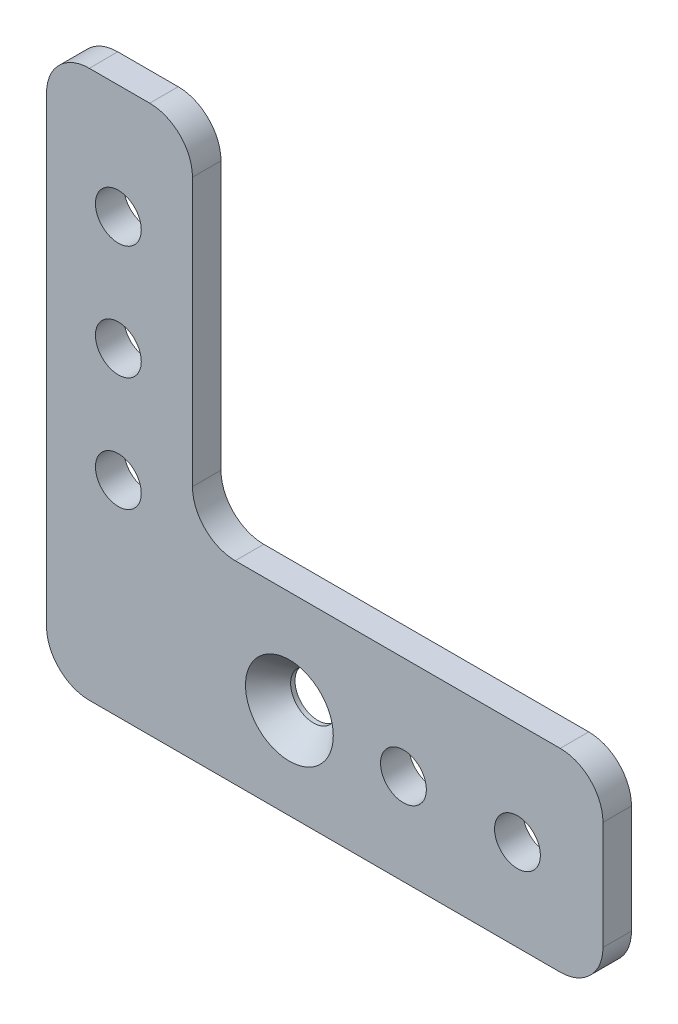
ISO-10303-21;
HEADER;
FILE_DESCRIPTION(('STEP AP214'),'2;1');
FILE_NAME('part.step','',(''),(''),'','','');
FILE_SCHEMA(('AUTOMOTIVE_DESIGN { 1 0 10303 214 1 1 1 1 }'));
ENDSEC;
DATA;
#1=APPLICATION_CONTEXT('core data for automotive mechanical design processes');
#2=APPLICATION_PROTOCOL_DEFINITION('international standard','automotive_design',2000,#1);
#3=PRODUCT_CONTEXT('',#1,'mechanical');
#4=PRODUCT('Part','Part','',(#3));
#5=PRODUCT_RELATED_PRODUCT_CATEGORY('part','',(#4));
#6=PRODUCT_DEFINITION_FORMATION('','',#4);
#7=PRODUCT_DEFINITION_CONTEXT('part definition',#1,'design');
#8=PRODUCT_DEFINITION('design','',#6,#7);
#9=PRODUCT_DEFINITION_SHAPE('','',#8);
#10=(LENGTH_UNIT() NAMED_UNIT(*) SI_UNIT(.MILLI.,.METRE.));
#11=(NAMED_UNIT(*) PLANE_ANGLE_UNIT() SI_UNIT($,.RADIAN.));
#12=(NAMED_UNIT(*) SI_UNIT($,.STERADIAN.) SOLID_ANGLE_UNIT());
#13=UNCERTAINTY_MEASURE_WITH_UNIT(LENGTH_MEASURE(1.E-05),#10,'distance_accuracy_value','');
#14=(GEOMETRIC_REPRESENTATION_CONTEXT(3) GLOBAL_UNCERTAINTY_ASSIGNED_CONTEXT((#13)) GLOBAL_UNIT_ASSIGNED_CONTEXT((#10,
#11,#12)) REPRESENTATION_CONTEXT('',''));
#15=CARTESIAN_POINT('',(0.,0.,0.));
#16=DIRECTION('',(0.,0.,1.));
#17=DIRECTION('',(1.,0.,0.));
#18=AXIS2_PLACEMENT_3D('',#15,#16,#17);
#19=CARTESIAN_POINT('',(-27.051,0.,3.175));
#20=DIRECTION('',(-1.,0.,0.));
#21=DIRECTION('',(0.,0.,1.));
#22=AXIS2_PLACEMENT_3D('',#19,#20,#21);
#23=PLANE('',#22);
#24=DIRECTION('',(0.,1.,0.));
#25=VECTOR('',#24,1.);
#26=CARTESIAN_POINT('',(-27.051,0.,3.175));
#27=LINE('',#26,#25);
#28=CARTESIAN_POINT('',(-27.051,-24.4475,3.175));
#29=VERTEX_POINT('',#28);
#30=CARTESIAN_POINT('',(-27.051,26.9875,3.175));
#31=VERTEX_POINT('',#30);
#32=EDGE_CURVE('E308',#29,#31,#27,.T.);
#33=ORIENTED_EDGE('',*,*,#32,.T.);
#34=DIRECTION('',(0.,0.,-1.));
#35=VECTOR('',#34,1.);
#36=CARTESIAN_POINT('',(-27.051,26.9875,3.175));
#37=LINE('',#36,#35);
#38=CARTESIAN_POINT('',(-27.051,26.9875,0.));
#39=VERTEX_POINT('',#38);
#40=EDGE_CURVE('E145',#31,#39,#37,.T.);
#41=ORIENTED_EDGE('',*,*,#40,.T.);
#42=DIRECTION('',(0.,1.,0.));
#43=VECTOR('',#42,1.);
#44=CARTESIAN_POINT('',(-27.051,0.,0.));
#45=LINE('',#44,#43);
#46=CARTESIAN_POINT('',(-27.051,-24.4475,0.));
#47=VERTEX_POINT('',#46);
#48=EDGE_CURVE('E136',#47,#39,#45,.T.);
#49=ORIENTED_EDGE('',*,*,#48,.F.);
#50=DIRECTION('',(0.,0.,-1.));
#51=VECTOR('',#50,1.);
#52=CARTESIAN_POINT('',(-27.051,-24.4475,3.175));
#53=LINE('',#52,#51);
#54=EDGE_CURVE('E150',#47,#29,#53,.F.);
#55=ORIENTED_EDGE('',*,*,#54,.T.);
#56=EDGE_LOOP('',(#33,#41,#49,#55));
#57=FACE_BOUND('',#56,.T.);
#58=ADVANCED_FACE('F43',(#57),#23,.T.);
#59=CARTESIAN_POINT('',(0.,-29.21,3.175));
#60=DIRECTION('',(0.,1.,0.));
#61=DIRECTION('',(0.,0.,1.));
#62=AXIS2_PLACEMENT_3D('',#59,#60,#61);
#63=PLANE('',#62);
#64=DIRECTION('',(1.,0.,0.));
#65=VECTOR('',#64,1.);
#66=CARTESIAN_POINT('',(0.,-29.21,0.));
#67=LINE('',#66,#65);
#68=CARTESIAN_POINT('',(-22.2885,-29.21,0.));
#69=VERTEX_POINT('',#68);
#70=CARTESIAN_POINT('',(30.1625,-29.21,0.));
#71=VERTEX_POINT('',#70);
#72=EDGE_CURVE('E138',#69,#71,#67,.T.);
#73=ORIENTED_EDGE('',*,*,#72,.T.);
#74=DIRECTION('',(0.,0.,-1.));
#75=VECTOR('',#74,1.);
#76=CARTESIAN_POINT('',(30.1625,-29.21,3.175));
#77=LINE('',#76,#75);
#78=CARTESIAN_POINT('',(30.1625,-29.21,3.175));
#79=VERTEX_POINT('',#78);
#80=EDGE_CURVE('E226',#71,#79,#77,.F.);
#81=ORIENTED_EDGE('',*,*,#80,.T.);
#82=DIRECTION('',(1.,0.,0.));
#83=VECTOR('',#82,1.);
#84=CARTESIAN_POINT('',(0.,-29.21,3.175));
#85=LINE('',#84,#83);
#86=CARTESIAN_POINT('',(-22.2885,-29.21,3.175));
#87=VERTEX_POINT('',#86);
#88=EDGE_CURVE('E311',#87,#79,#85,.T.);
#89=ORIENTED_EDGE('',*,*,#88,.F.);
#90=DIRECTION('',(0.,0.,-1.));
#91=VECTOR('',#90,1.);
#92=CARTESIAN_POINT('',(-22.2885,-29.21,0.));
#93=LINE('',#92,#91);
#94=EDGE_CURVE('E223',#87,#69,#93,.T.);
#95=ORIENTED_EDGE('',*,*,#94,.T.);
#96=EDGE_LOOP('',(#73,#81,#89,#95));
#97=FACE_BOUND('',#96,.T.);
#98=ADVANCED_FACE('F332',(#97),#63,.F.);
#99=CARTESIAN_POINT('',(34.925,0.,3.175));
#100=DIRECTION('',(-1.,0.,0.));
#101=DIRECTION('',(0.,0.,1.));
#102=AXIS2_PLACEMENT_3D('',#99,#100,#101);
#103=PLANE('',#102);
#104=DIRECTION('',(0.,1.,0.));
#105=VECTOR('',#104,1.);
#106=CARTESIAN_POINT('',(34.925,0.,0.));
#107=LINE('',#106,#105);
#108=CARTESIAN_POINT('',(34.925,-24.4475,0.));
#109=VERTEX_POINT('',#108);
#110=CARTESIAN_POINT('',(34.925,-12.3825,0.));
#111=VERTEX_POINT('',#110);
#112=EDGE_CURVE('E242',#109,#111,#107,.T.);
#113=ORIENTED_EDGE('',*,*,#112,.T.);
#114=DIRECTION('',(0.,0.,-1.));
#115=VECTOR('',#114,1.);
#116=CARTESIAN_POINT('',(34.925,-12.3825,3.175));
#117=LINE('',#116,#115);
#118=CARTESIAN_POINT('',(34.925,-12.3825,3.175));
#119=VERTEX_POINT('',#118);
#120=EDGE_CURVE('E220',#111,#119,#117,.F.);
#121=ORIENTED_EDGE('',*,*,#120,.T.);
#122=DIRECTION('',(0.,1.,0.));
#123=VECTOR('',#122,1.);
#124=CARTESIAN_POINT('',(34.925,0.,3.175));
#125=LINE('',#124,#123);
#126=CARTESIAN_POINT('',(34.925,-24.4475,3.175));
#127=VERTEX_POINT('',#126);
#128=EDGE_CURVE('E251',#127,#119,#125,.T.);
#129=ORIENTED_EDGE('',*,*,#128,.F.);
#130=DIRECTION('',(0.,0.,-1.));
#131=VECTOR('',#130,1.);
#132=CARTESIAN_POINT('',(34.925,-24.4475,3.175));
#133=LINE('',#132,#131);
#134=EDGE_CURVE('E216',#127,#109,#133,.T.);
#135=ORIENTED_EDGE('',*,*,#134,.T.);
#136=EDGE_LOOP('',(#113,#121,#129,#135));
#137=FACE_BOUND('',#136,.T.);
#138=ADVANCED_FACE('F327',(#137),#103,.F.);
#139=CARTESIAN_POINT('',(0.,-7.62000000000001,3.175));
#140=DIRECTION('',(0.,-1.,0.));
#141=DIRECTION('',(1.,0.,0.));
#142=AXIS2_PLACEMENT_3D('',#139,#140,#141);
#143=PLANE('',#142);
#144=DIRECTION('',(-1.,0.,0.));
#145=VECTOR('',#144,1.);
#146=CARTESIAN_POINT('',(0.,-7.62000000000001,0.));
#147=LINE('',#146,#145);
#148=CARTESIAN_POINT('',(30.1625,-7.62000000000001,0.));
#149=VERTEX_POINT('',#148);
#150=CARTESIAN_POINT('',(-6.0325,-7.62000000000002,0.));
#151=VERTEX_POINT('',#150);
#152=EDGE_CURVE('E232',#149,#151,#147,.T.);
#153=ORIENTED_EDGE('',*,*,#152,.T.);
#154=DIRECTION('',(0.,0.,-1.));
#155=VECTOR('',#154,1.);
#156=CARTESIAN_POINT('',(-6.0325,-7.62000000000002,3.175));
#157=LINE('',#156,#155);
#158=CARTESIAN_POINT('',(-6.0325,-7.62000000000002,3.175));
#159=VERTEX_POINT('',#158);
#160=EDGE_CURVE('E213',#151,#159,#157,.F.);
#161=ORIENTED_EDGE('',*,*,#160,.T.);
#162=DIRECTION('',(-1.,0.,0.));
#163=VECTOR('',#162,1.);
#164=CARTESIAN_POINT('',(0.,-7.62000000000001,3.175));
#165=LINE('',#164,#163);
#166=CARTESIAN_POINT('',(30.1625,-7.62000000000001,3.175));
#167=VERTEX_POINT('',#166);
#168=EDGE_CURVE('E248',#167,#159,#165,.T.);
#169=ORIENTED_EDGE('',*,*,#168,.F.);
#170=DIRECTION('',(0.,0.,-1.));
#171=VECTOR('',#170,1.);
#172=CARTESIAN_POINT('',(30.1625,-7.62000000000001,3.175));
#173=LINE('',#172,#171);
#174=EDGE_CURVE('E209',#167,#149,#173,.T.);
#175=ORIENTED_EDGE('',*,*,#174,.T.);
#176=EDGE_LOOP('',(#153,#161,#169,#175));
#177=FACE_BOUND('',#176,.T.);
#178=ADVANCED_FACE('F238',(#177),#143,.F.);
#179=CARTESIAN_POINT('',(-10.795,0.,3.175));
#180=DIRECTION('',(1.,0.,0.));
#181=DIRECTION('',(0.,1.,0.));
#182=AXIS2_PLACEMENT_3D('',#179,#180,#181);
#183=PLANE('',#182);
#184=DIRECTION('',(0.,-1.,0.));
#185=VECTOR('',#184,1.);
#186=CARTESIAN_POINT('',(-10.795,0.,0.));
#187=LINE('',#186,#185);
#188=CARTESIAN_POINT('',(-10.795,26.9875,0.));
#189=VERTEX_POINT('',#188);
#190=CARTESIAN_POINT('',(-10.795,-2.85750000000002,0.));
#191=VERTEX_POINT('',#190);
#192=EDGE_CURVE('E233',#189,#191,#187,.T.);
#193=ORIENTED_EDGE('',*,*,#192,.F.);
#194=DIRECTION('',(0.,0.,-1.));
#195=VECTOR('',#194,1.);
#196=CARTESIAN_POINT('',(-10.795,26.9875,3.175));
#197=LINE('',#196,#195);
#198=CARTESIAN_POINT('',(-10.795,26.9875,3.175));
#199=VERTEX_POINT('',#198);
#200=EDGE_CURVE('E64',#189,#199,#197,.F.);
#201=ORIENTED_EDGE('',*,*,#200,.T.);
#202=DIRECTION('',(0.,-1.,0.));
#203=VECTOR('',#202,1.);
#204=CARTESIAN_POINT('',(-10.795,0.,3.175));
#205=LINE('',#204,#203);
#206=CARTESIAN_POINT('',(-10.795,-2.85750000000002,3.175));
#207=VERTEX_POINT('',#206);
#208=EDGE_CURVE('E165',#199,#207,#205,.T.);
#209=ORIENTED_EDGE('',*,*,#208,.T.);
#210=DIRECTION('',(0.,0.,-1.));
#211=VECTOR('',#210,1.);
#212=CARTESIAN_POINT('',(-10.795,-2.85750000000002,3.175));
#213=LINE('',#212,#211);
#214=EDGE_CURVE('E203',#207,#191,#213,.T.);
#215=ORIENTED_EDGE('',*,*,#214,.T.);
#216=EDGE_LOOP('',(#193,#201,#209,#215));
#217=FACE_BOUND('',#216,.T.);
#218=ADVANCED_FACE('F245',(#217),#183,.T.);
#219=CARTESIAN_POINT('',(-19.05,-6.35000000000001,3.175));
#220=DIRECTION('',(0.,0.,-1.));
#221=DIRECTION('',(-1.,0.,0.));
#222=AXIS2_PLACEMENT_3D('',#219,#220,#221);
#223=CYLINDRICAL_SURFACE('',#222,2.5527);
#224=CARTESIAN_POINT('',(-19.05,-6.35000000000001,3.175));
#225=DIRECTION('',(0.,0.,1.));
#226=DIRECTION('',(1.,0.,0.));
#227=AXIS2_PLACEMENT_3D('',#224,#225,#226);
#228=CIRCLE('',#227,2.5527);
#229=CARTESIAN_POINT('',(-16.4973,-6.35000000000001,3.175));
#230=VERTEX_POINT('',#229);
#231=EDGE_CURVE('E304',#230,#230,#228,.T.);
#232=ORIENTED_EDGE('',*,*,#231,.T.);
#233=EDGE_LOOP('',(#232));
#234=FACE_BOUND('',#233,.T.);
#235=CARTESIAN_POINT('',(-19.05,-6.35000000000001,0.));
#236=DIRECTION('',(0.,0.,1.));
#237=DIRECTION('',(1.,0.,0.));
#238=AXIS2_PLACEMENT_3D('',#235,#236,#237);
#239=CIRCLE('',#238,2.5527);
#240=CARTESIAN_POINT('',(-16.4973,-6.35000000000001,0.));
#241=VERTEX_POINT('',#240);
#242=EDGE_CURVE('E154',#241,#241,#239,.T.);
#243=ORIENTED_EDGE('',*,*,#242,.F.);
#244=EDGE_LOOP('',(#243));
#245=FACE_BOUND('',#244,.T.);
#246=ADVANCED_FACE('F359',(#234,#245),#223,.F.);
#247=CARTESIAN_POINT('',(-19.05,6.34999999999999,3.175));
#248=DIRECTION('',(0.,0.,-1.));
#249=DIRECTION('',(-1.,0.,0.));
#250=AXIS2_PLACEMENT_3D('',#247,#248,#249);
#251=CYLINDRICAL_SURFACE('',#250,2.5527);
#252=CARTESIAN_POINT('',(-19.05,6.34999999999999,3.175));
#253=DIRECTION('',(0.,0.,1.));
#254=DIRECTION('',(1.,0.,0.));
#255=AXIS2_PLACEMENT_3D('',#252,#253,#254);
#256=CIRCLE('',#255,2.5527);
#257=CARTESIAN_POINT('',(-16.4973,6.34999999999999,3.175));
#258=VERTEX_POINT('',#257);
#259=EDGE_CURVE('E300',#258,#258,#256,.T.);
#260=ORIENTED_EDGE('',*,*,#259,.T.);
#261=EDGE_LOOP('',(#260));
#262=FACE_BOUND('',#261,.T.);
#263=CARTESIAN_POINT('',(-19.05,6.34999999999999,0.));
#264=DIRECTION('',(0.,0.,1.));
#265=DIRECTION('',(1.,0.,0.));
#266=AXIS2_PLACEMENT_3D('',#263,#264,#265);
#267=CIRCLE('',#266,2.5527);
#268=CARTESIAN_POINT('',(-16.4973,6.34999999999999,0.));
#269=VERTEX_POINT('',#268);
#270=EDGE_CURVE('E268',#269,#269,#267,.T.);
#271=ORIENTED_EDGE('',*,*,#270,.F.);
#272=EDGE_LOOP('',(#271));
#273=FACE_BOUND('',#272,.T.);
#274=ADVANCED_FACE('F362',(#262,#273),#251,.F.);
#275=CARTESIAN_POINT('',(-19.05,19.05,3.175));
#276=DIRECTION('',(0.,0.,-1.));
#277=DIRECTION('',(-1.,0.,0.));
#278=AXIS2_PLACEMENT_3D('',#275,#276,#277);
#279=CYLINDRICAL_SURFACE('',#278,2.5527);
#280=CARTESIAN_POINT('',(-19.05,19.05,3.175));
#281=DIRECTION('',(0.,0.,1.));
#282=DIRECTION('',(1.,0.,0.));
#283=AXIS2_PLACEMENT_3D('',#280,#281,#282);
#284=CIRCLE('',#283,2.5527);
#285=CARTESIAN_POINT('',(-16.4973,19.05,3.175));
#286=VERTEX_POINT('',#285);
#287=EDGE_CURVE('E292',#286,#286,#284,.T.);
#288=ORIENTED_EDGE('',*,*,#287,.T.);
#289=EDGE_LOOP('',(#288));
#290=FACE_BOUND('',#289,.T.);
#291=CARTESIAN_POINT('',(-19.05,19.05,0.));
#292=DIRECTION('',(0.,0.,1.));
#293=DIRECTION('',(1.,0.,0.));
#294=AXIS2_PLACEMENT_3D('',#291,#292,#293);
#295=CIRCLE('',#294,2.5527);
#296=CARTESIAN_POINT('',(-16.4973,19.05,0.));
#297=VERTEX_POINT('',#296);
#298=EDGE_CURVE('E264',#297,#297,#295,.T.);
#299=ORIENTED_EDGE('',*,*,#298,.F.);
#300=EDGE_LOOP('',(#299));
#301=FACE_BOUND('',#300,.T.);
#302=ADVANCED_FACE('F366',(#290,#301),#279,.F.);
#303=CARTESIAN_POINT('',(12.7,-19.05,3.175));
#304=DIRECTION('',(0.,0.,-1.));
#305=DIRECTION('',(-1.,0.,0.));
#306=AXIS2_PLACEMENT_3D('',#303,#304,#305);
#307=CYLINDRICAL_SURFACE('',#306,2.5527);
#308=CARTESIAN_POINT('',(12.7,-19.05,3.175));
#309=DIRECTION('',(0.,0.,1.));
#310=DIRECTION('',(1.,0.,0.));
#311=AXIS2_PLACEMENT_3D('',#308,#309,#310);
#312=CIRCLE('',#311,2.5527);
#313=CARTESIAN_POINT('',(15.2527,-19.05,3.175));
#314=VERTEX_POINT('',#313);
#315=EDGE_CURVE('E286',#314,#314,#312,.T.);
#316=ORIENTED_EDGE('',*,*,#315,.T.);
#317=EDGE_LOOP('',(#316));
#318=FACE_BOUND('',#317,.T.);
#319=CARTESIAN_POINT('',(12.7,-19.05,0.));
#320=DIRECTION('',(0.,0.,1.));
#321=DIRECTION('',(1.,0.,0.));
#322=AXIS2_PLACEMENT_3D('',#319,#320,#321);
#323=CIRCLE('',#322,2.5527);
#324=CARTESIAN_POINT('',(15.2527,-19.05,0.));
#325=VERTEX_POINT('',#324);
#326=EDGE_CURVE('E259',#325,#325,#323,.T.);
#327=ORIENTED_EDGE('',*,*,#326,.F.);
#328=EDGE_LOOP('',(#327));
#329=FACE_BOUND('',#328,.T.);
#330=ADVANCED_FACE('F370',(#318,#329),#307,.F.);
#331=CARTESIAN_POINT('',(25.4,-19.05,3.175));
#332=DIRECTION('',(0.,0.,-1.));
#333=DIRECTION('',(-1.,0.,0.));
#334=AXIS2_PLACEMENT_3D('',#331,#332,#333);
#335=CYLINDRICAL_SURFACE('',#334,2.5527);
#336=CARTESIAN_POINT('',(25.4,-19.05,3.175));
#337=DIRECTION('',(0.,0.,1.));
#338=DIRECTION('',(1.,0.,0.));
#339=AXIS2_PLACEMENT_3D('',#336,#337,#338);
#340=CIRCLE('',#339,2.5527);
#341=CARTESIAN_POINT('',(27.9527,-19.05,3.175));
#342=VERTEX_POINT('',#341);
#343=EDGE_CURVE('E282',#342,#342,#340,.T.);
#344=ORIENTED_EDGE('',*,*,#343,.T.);
#345=EDGE_LOOP('',(#344));
#346=FACE_BOUND('',#345,.T.);
#347=CARTESIAN_POINT('',(25.4,-19.05,0.));
#348=DIRECTION('',(0.,0.,1.));
#349=DIRECTION('',(1.,0.,0.));
#350=AXIS2_PLACEMENT_3D('',#347,#348,#349);
#351=CIRCLE('',#350,2.5527);
#352=CARTESIAN_POINT('',(27.9527,-19.05,0.));
#353=VERTEX_POINT('',#352);
#354=EDGE_CURVE('E255',#353,#353,#351,.T.);
#355=ORIENTED_EDGE('',*,*,#354,.F.);
#356=EDGE_LOOP('',(#355));
#357=FACE_BOUND('',#356,.T.);
#358=ADVANCED_FACE('F374',(#346,#357),#335,.F.);
#359=CARTESIAN_POINT('',(0.,31.75,3.175));
#360=DIRECTION('',(0.,1.,0.));
#361=DIRECTION('',(-1.,0.,0.));
#362=AXIS2_PLACEMENT_3D('',#359,#360,#361);
#363=PLANE('',#362);
#364=DIRECTION('',(1.,0.,0.));
#365=VECTOR('',#364,1.);
#366=CARTESIAN_POINT('',(0.,31.75,0.));
#367=LINE('',#366,#365);
#368=CARTESIAN_POINT('',(-22.2885,31.75,0.));
#369=VERTEX_POINT('',#368);
#370=CARTESIAN_POINT('',(-15.5575,31.75,0.));
#371=VERTEX_POINT('',#370);
#372=EDGE_CURVE('E168',#369,#371,#367,.T.);
#373=ORIENTED_EDGE('',*,*,#372,.F.);
#374=DIRECTION('',(0.,0.,-1.));
#375=VECTOR('',#374,1.);
#376=CARTESIAN_POINT('',(-22.2885,31.75,3.175));
#377=LINE('',#376,#375);
#378=CARTESIAN_POINT('',(-22.2885,31.75,3.175));
#379=VERTEX_POINT('',#378);
#380=EDGE_CURVE('E186',#369,#379,#377,.F.);
#381=ORIENTED_EDGE('',*,*,#380,.T.);
#382=DIRECTION('',(1.,0.,0.));
#383=VECTOR('',#382,1.);
#384=CARTESIAN_POINT('',(0.,31.75,3.175));
#385=LINE('',#384,#383);
#386=CARTESIAN_POINT('',(-15.5575,31.75,3.175));
#387=VERTEX_POINT('',#386);
#388=EDGE_CURVE('E159',#379,#387,#385,.T.);
#389=ORIENTED_EDGE('',*,*,#388,.T.);
#390=DIRECTION('',(0.,0.,-1.));
#391=VECTOR('',#390,1.);
#392=CARTESIAN_POINT('',(-15.5575,31.75,3.175));
#393=LINE('',#392,#391);
#394=EDGE_CURVE('E182',#387,#371,#393,.T.);
#395=ORIENTED_EDGE('',*,*,#394,.T.);
#396=EDGE_LOOP('',(#373,#381,#389,#395));
#397=FACE_BOUND('',#396,.T.);
#398=ADVANCED_FACE('F339',(#397),#363,.T.);
#399=CARTESIAN_POINT('',(0.,0.,3.175));
#400=DIRECTION('',(0.,0.,1.));
#401=DIRECTION('',(1.,0.,0.));
#402=AXIS2_PLACEMENT_3D('',#399,#400,#401);
#403=PLANE('',#402);
#404=CARTESIAN_POINT('',(0.,-19.05,3.175));
#405=DIRECTION('',(0.,0.,1.));
#406=DIRECTION('',(1.,0.,0.));
#407=AXIS2_PLACEMENT_3D('',#404,#405,#406);
#408=CIRCLE('',#407,4.8895);
#409=CARTESIAN_POINT('',(4.88949999999998,-19.05,3.175));
#410=VERTEX_POINT('',#409);
#411=EDGE_CURVE('E543',#410,#410,#408,.T.);
#412=ORIENTED_EDGE('',*,*,#411,.F.);
#413=EDGE_LOOP('',(#412));
#414=FACE_BOUND('',#413,.T.);
#415=ORIENTED_EDGE('',*,*,#343,.F.);
#416=EDGE_LOOP('',(#415));
#417=FACE_BOUND('',#416,.T.);
#418=ORIENTED_EDGE('',*,*,#315,.F.);
#419=EDGE_LOOP('',(#418));
#420=FACE_BOUND('',#419,.T.);
#421=ORIENTED_EDGE('',*,*,#287,.F.);
#422=EDGE_LOOP('',(#421));
#423=FACE_BOUND('',#422,.T.);
#424=ORIENTED_EDGE('',*,*,#259,.F.);
#425=EDGE_LOOP('',(#424));
#426=FACE_BOUND('',#425,.T.);
#427=ORIENTED_EDGE('',*,*,#231,.F.);
#428=EDGE_LOOP('',(#427));
#429=FACE_BOUND('',#428,.T.);
#430=ORIENTED_EDGE('',*,*,#388,.F.);
#431=CARTESIAN_POINT('',(-22.2885,26.9875,3.175));
#432=DIRECTION('',(0.,0.,1.));
#433=DIRECTION('',(1.,0.,0.));
#434=AXIS2_PLACEMENT_3D('',#431,#432,#433);
#435=CIRCLE('',#434,4.7625);
#436=EDGE_CURVE('E200',#379,#31,#435,.T.);
#437=ORIENTED_EDGE('',*,*,#436,.T.);
#438=ORIENTED_EDGE('',*,*,#32,.F.);
#439=CARTESIAN_POINT('',(-22.2885,-24.4475,3.175));
#440=DIRECTION('',(0.,0.,1.));
#441=DIRECTION('',(1.,0.,0.));
#442=AXIS2_PLACEMENT_3D('',#439,#440,#441);
#443=CIRCLE('',#442,4.7625);
#444=EDGE_CURVE('E157',#29,#87,#443,.T.);
#445=ORIENTED_EDGE('',*,*,#444,.T.);
#446=ORIENTED_EDGE('',*,*,#88,.T.);
#447=CARTESIAN_POINT('',(30.1625,-24.4475,3.175));
#448=DIRECTION('',(0.,0.,1.));
#449=DIRECTION('',(1.,0.,0.));
#450=AXIS2_PLACEMENT_3D('',#447,#448,#449);
#451=CIRCLE('',#450,4.7625);
#452=EDGE_CURVE('E191',#79,#127,#451,.T.);
#453=ORIENTED_EDGE('',*,*,#452,.T.);
#454=ORIENTED_EDGE('',*,*,#128,.T.);
#455=CARTESIAN_POINT('',(30.1625,-12.3825,3.175));
#456=DIRECTION('',(0.,0.,1.));
#457=DIRECTION('',(1.,0.,0.));
#458=AXIS2_PLACEMENT_3D('',#455,#456,#457);
#459=CIRCLE('',#458,4.7625);
#460=EDGE_CURVE('E194',#119,#167,#459,.T.);
#461=ORIENTED_EDGE('',*,*,#460,.T.);
#462=ORIENTED_EDGE('',*,*,#168,.T.);
#463=CARTESIAN_POINT('',(-6.0325,-2.85750000000001,3.175));
#464=DIRECTION('',(0.,0.,1.));
#465=DIRECTION('',(1.,0.,0.));
#466=AXIS2_PLACEMENT_3D('',#463,#464,#465);
#467=CIRCLE('',#466,4.7625);
#468=EDGE_CURVE('E11',#159,#207,#467,.F.);
#469=ORIENTED_EDGE('',*,*,#468,.T.);
#470=ORIENTED_EDGE('',*,*,#208,.F.);
#471=CARTESIAN_POINT('',(-15.5575,26.9875,3.175));
#472=DIRECTION('',(0.,0.,1.));
#473=DIRECTION('',(1.,0.,0.));
#474=AXIS2_PLACEMENT_3D('',#471,#472,#473);
#475=CIRCLE('',#474,4.7625);
#476=EDGE_CURVE('E197',#199,#387,#475,.T.);
#477=ORIENTED_EDGE('',*,*,#476,.T.);
#478=EDGE_LOOP('',(#430,#437,#438,#445,#446,#453,#454,#461,#462,#469,#470,#477));
#479=FACE_BOUND('',#478,.T.);
#480=ADVANCED_FACE('F319',(#414,#417,#420,#423,#426,#429,#479),#403,.T.);
#481=CARTESIAN_POINT('',(0.,0.,0.));
#482=DIRECTION('',(0.,0.,1.));
#483=DIRECTION('',(1.,0.,0.));
#484=AXIS2_PLACEMENT_3D('',#481,#482,#483);
#485=PLANE('',#484);
#486=CARTESIAN_POINT('',(0.,-19.05,0.));
#487=DIRECTION('',(0.,0.,1.));
#488=DIRECTION('',(1.,0.,0.));
#489=AXIS2_PLACEMENT_3D('',#486,#487,#488);
#490=CIRCLE('',#489,2.5527);
#491=CARTESIAN_POINT('',(2.55269999999998,-19.05,0.));
#492=VERTEX_POINT('',#491);
#493=EDGE_CURVE('E260',#492,#492,#490,.T.);
#494=ORIENTED_EDGE('',*,*,#493,.T.);
#495=EDGE_LOOP('',(#494));
#496=FACE_BOUND('',#495,.T.);
#497=ORIENTED_EDGE('',*,*,#354,.T.);
#498=EDGE_LOOP('',(#497));
#499=FACE_BOUND('',#498,.T.);
#500=ORIENTED_EDGE('',*,*,#326,.T.);
#501=EDGE_LOOP('',(#500));
#502=FACE_BOUND('',#501,.T.);
#503=ORIENTED_EDGE('',*,*,#298,.T.);
#504=EDGE_LOOP('',(#503));
#505=FACE_BOUND('',#504,.T.);
#506=ORIENTED_EDGE('',*,*,#270,.T.);
#507=EDGE_LOOP('',(#506));
#508=FACE_BOUND('',#507,.T.);
#509=ORIENTED_EDGE('',*,*,#242,.T.);
#510=EDGE_LOOP('',(#509));
#511=FACE_BOUND('',#510,.T.);
#512=ORIENTED_EDGE('',*,*,#48,.T.);
#513=CARTESIAN_POINT('',(-22.2885,26.9875,0.));
#514=DIRECTION('',(0.,0.,1.));
#515=DIRECTION('',(1.,0.,0.));
#516=AXIS2_PLACEMENT_3D('',#513,#514,#515);
#517=CIRCLE('',#516,4.7625);
#518=EDGE_CURVE('E179',#39,#369,#517,.F.);
#519=ORIENTED_EDGE('',*,*,#518,.T.);
#520=ORIENTED_EDGE('',*,*,#372,.T.);
#521=CARTESIAN_POINT('',(-15.5575,26.9875,0.));
#522=DIRECTION('',(0.,0.,1.));
#523=DIRECTION('',(1.,0.,0.));
#524=AXIS2_PLACEMENT_3D('',#521,#522,#523);
#525=CIRCLE('',#524,4.7625);
#526=EDGE_CURVE('E176',#371,#189,#525,.F.);
#527=ORIENTED_EDGE('',*,*,#526,.T.);
#528=ORIENTED_EDGE('',*,*,#192,.T.);
#529=CARTESIAN_POINT('',(-6.0325,-2.85750000000001,0.));
#530=DIRECTION('',(0.,0.,1.));
#531=DIRECTION('',(1.,0.,0.));
#532=AXIS2_PLACEMENT_3D('',#529,#530,#531);
#533=CIRCLE('',#532,4.7625);
#534=EDGE_CURVE('E52',#191,#151,#533,.T.);
#535=ORIENTED_EDGE('',*,*,#534,.T.);
#536=ORIENTED_EDGE('',*,*,#152,.F.);
#537=CARTESIAN_POINT('',(30.1625,-12.3825,0.));
#538=DIRECTION('',(0.,0.,1.));
#539=DIRECTION('',(1.,0.,0.));
#540=AXIS2_PLACEMENT_3D('',#537,#538,#539);
#541=CIRCLE('',#540,4.7625);
#542=EDGE_CURVE('E173',#149,#111,#541,.F.);
#543=ORIENTED_EDGE('',*,*,#542,.T.);
#544=ORIENTED_EDGE('',*,*,#112,.F.);
#545=CARTESIAN_POINT('',(30.1625,-24.4475,0.));
#546=DIRECTION('',(0.,0.,1.));
#547=DIRECTION('',(1.,0.,0.));
#548=AXIS2_PLACEMENT_3D('',#545,#546,#547);
#549=CIRCLE('',#548,4.7625);
#550=EDGE_CURVE('E144',#109,#71,#549,.F.);
#551=ORIENTED_EDGE('',*,*,#550,.T.);
#552=ORIENTED_EDGE('',*,*,#72,.F.);
#553=CARTESIAN_POINT('',(-22.2885,-24.4475,0.));
#554=DIRECTION('',(0.,0.,1.));
#555=DIRECTION('',(1.,0.,0.));
#556=AXIS2_PLACEMENT_3D('',#553,#554,#555);
#557=CIRCLE('',#556,4.7625);
#558=EDGE_CURVE('E133',#69,#47,#557,.F.);
#559=ORIENTED_EDGE('',*,*,#558,.T.);
#560=EDGE_LOOP('',(#512,#519,#520,#527,#528,#535,#536,#543,#544,#551,#552,#559));
#561=FACE_BOUND('',#560,.T.);
#562=ADVANCED_FACE('F135',(#496,#499,#502,#505,#508,#511,#561),#485,.F.);
#563=CARTESIAN_POINT('',(-22.2885,26.9875,3.175));
#564=DIRECTION('',(0.,0.,-1.));
#565=DIRECTION('',(-1.,0.,0.));
#566=AXIS2_PLACEMENT_3D('',#563,#564,#565);
#567=CYLINDRICAL_SURFACE('',#566,4.7625);
#568=ORIENTED_EDGE('',*,*,#436,.F.);
#569=ORIENTED_EDGE('',*,*,#380,.F.);
#570=ORIENTED_EDGE('',*,*,#518,.F.);
#571=ORIENTED_EDGE('',*,*,#40,.F.);
#572=EDGE_LOOP('',(#568,#569,#570,#571));
#573=FACE_BOUND('',#572,.T.);
#574=ADVANCED_FACE('F336',(#573),#567,.T.);
#575=CARTESIAN_POINT('',(-15.5575,26.9875,3.175));
#576=DIRECTION('',(0.,0.,-1.));
#577=DIRECTION('',(-1.,0.,0.));
#578=AXIS2_PLACEMENT_3D('',#575,#576,#577);
#579=CYLINDRICAL_SURFACE('',#578,4.7625);
#580=ORIENTED_EDGE('',*,*,#476,.F.);
#581=ORIENTED_EDGE('',*,*,#200,.F.);
#582=ORIENTED_EDGE('',*,*,#526,.F.);
#583=ORIENTED_EDGE('',*,*,#394,.F.);
#584=EDGE_LOOP('',(#580,#581,#582,#583));
#585=FACE_BOUND('',#584,.T.);
#586=ADVANCED_FACE('F342',(#585),#579,.T.);
#587=CARTESIAN_POINT('',(-6.0325,-2.85750000000001,3.175));
#588=DIRECTION('',(0.,0.,-1.));
#589=DIRECTION('',(-1.,0.,0.));
#590=AXIS2_PLACEMENT_3D('',#587,#588,#589);
#591=CYLINDRICAL_SURFACE('',#590,4.7625);
#592=ORIENTED_EDGE('',*,*,#468,.F.);
#593=ORIENTED_EDGE('',*,*,#160,.F.);
#594=ORIENTED_EDGE('',*,*,#534,.F.);
#595=ORIENTED_EDGE('',*,*,#214,.F.);
#596=EDGE_LOOP('',(#592,#593,#594,#595));
#597=FACE_BOUND('',#596,.T.);
#598=ADVANCED_FACE('F244',(#597),#591,.F.);
#599=CARTESIAN_POINT('',(30.1625,-12.3825,3.175));
#600=DIRECTION('',(0.,0.,-1.));
#601=DIRECTION('',(-1.,0.,0.));
#602=AXIS2_PLACEMENT_3D('',#599,#600,#601);
#603=CYLINDRICAL_SURFACE('',#602,4.7625);
#604=ORIENTED_EDGE('',*,*,#460,.F.);
#605=ORIENTED_EDGE('',*,*,#120,.F.);
#606=ORIENTED_EDGE('',*,*,#542,.F.);
#607=ORIENTED_EDGE('',*,*,#174,.F.);
#608=EDGE_LOOP('',(#604,#605,#606,#607));
#609=FACE_BOUND('',#608,.T.);
#610=ADVANCED_FACE('F325',(#609),#603,.T.);
#611=CARTESIAN_POINT('',(30.1625,-24.4475,3.175));
#612=DIRECTION('',(0.,0.,-1.));
#613=DIRECTION('',(-1.,0.,0.));
#614=AXIS2_PLACEMENT_3D('',#611,#612,#613);
#615=CYLINDRICAL_SURFACE('',#614,4.7625);
#616=ORIENTED_EDGE('',*,*,#452,.F.);
#617=ORIENTED_EDGE('',*,*,#80,.F.);
#618=ORIENTED_EDGE('',*,*,#550,.F.);
#619=ORIENTED_EDGE('',*,*,#134,.F.);
#620=EDGE_LOOP('',(#616,#617,#618,#619));
#621=FACE_BOUND('',#620,.T.);
#622=ADVANCED_FACE('F329',(#621),#615,.T.);
#623=CARTESIAN_POINT('',(-22.2885,-24.4475,3.175));
#624=DIRECTION('',(0.,0.,1.));
#625=DIRECTION('',(1.,0.,0.));
#626=AXIS2_PLACEMENT_3D('',#623,#624,#625);
#627=CYLINDRICAL_SURFACE('',#626,4.7625);
#628=ORIENTED_EDGE('',*,*,#444,.F.);
#629=ORIENTED_EDGE('',*,*,#54,.F.);
#630=ORIENTED_EDGE('',*,*,#558,.F.);
#631=ORIENTED_EDGE('',*,*,#94,.F.);
#632=EDGE_LOOP('',(#628,#629,#630,#631));
#633=FACE_BOUND('',#632,.T.);
#634=ADVANCED_FACE('F45',(#633),#627,.T.);
#635=CARTESIAN_POINT('',(0.,-19.05,3.175));
#636=DIRECTION('',(0.,0.,1.));
#637=DIRECTION('',(1.,0.,0.));
#638=AXIS2_PLACEMENT_3D('',#635,#636,#637);
#639=CYLINDRICAL_SURFACE('',#638,2.5527);
#640=ORIENTED_EDGE('',*,*,#493,.F.);
#641=EDGE_LOOP('',(#640));
#642=FACE_BOUND('',#641,.T.);
#643=CARTESIAN_POINT('',(0.,-19.05,0.486819106005945));
#644=DIRECTION('',(0.,0.,1.));
#645=DIRECTION('',(1.,0.,0.));
#646=AXIS2_PLACEMENT_3D('',#643,#644,#645);
#647=CIRCLE('',#646,2.5527);
#648=CARTESIAN_POINT('',(2.55269999999998,-19.05,0.486819106005945));
#649=VERTEX_POINT('',#648);
#650=EDGE_CURVE('E540',#649,#649,#647,.T.);
#651=ORIENTED_EDGE('',*,*,#650,.T.);
#652=EDGE_LOOP('',(#651));
#653=FACE_BOUND('',#652,.T.);
#654=ADVANCED_FACE('F515',(#642,#653),#639,.F.);
#655=CARTESIAN_POINT('',(0.,-19.05,3.175));
#656=DIRECTION('',(0.,0.,1.));
#657=DIRECTION('',(1.,0.,0.));
#658=AXIS2_PLACEMENT_3D('',#655,#656,#657);
#659=CONICAL_SURFACE('',#658,4.8895,0.715584993317675);
#660=ORIENTED_EDGE('',*,*,#650,.F.);
#661=EDGE_LOOP('',(#660));
#662=FACE_BOUND('',#661,.T.);
#663=ORIENTED_EDGE('',*,*,#411,.T.);
#664=EDGE_LOOP('',(#663));
#665=FACE_BOUND('',#664,.T.);
#666=ADVANCED_FACE('F521',(#662,#665),#659,.F.);
#667=CLOSED_SHELL('',(#58,#98,#138,#178,#218,#246,#274,#302,#330,#358,#398,#480,#562,#574,#586,
#598,#610,#622,#634,#654,#666));
#668=MANIFOLD_SOLID_BREP('B2',#667);
#669=ADVANCED_BREP_SHAPE_REPRESENTATION('',(#18,#668),#14);
#670=SHAPE_DEFINITION_REPRESENTATION(#9,#669);
ENDSEC;
END-ISO-10303-21;
